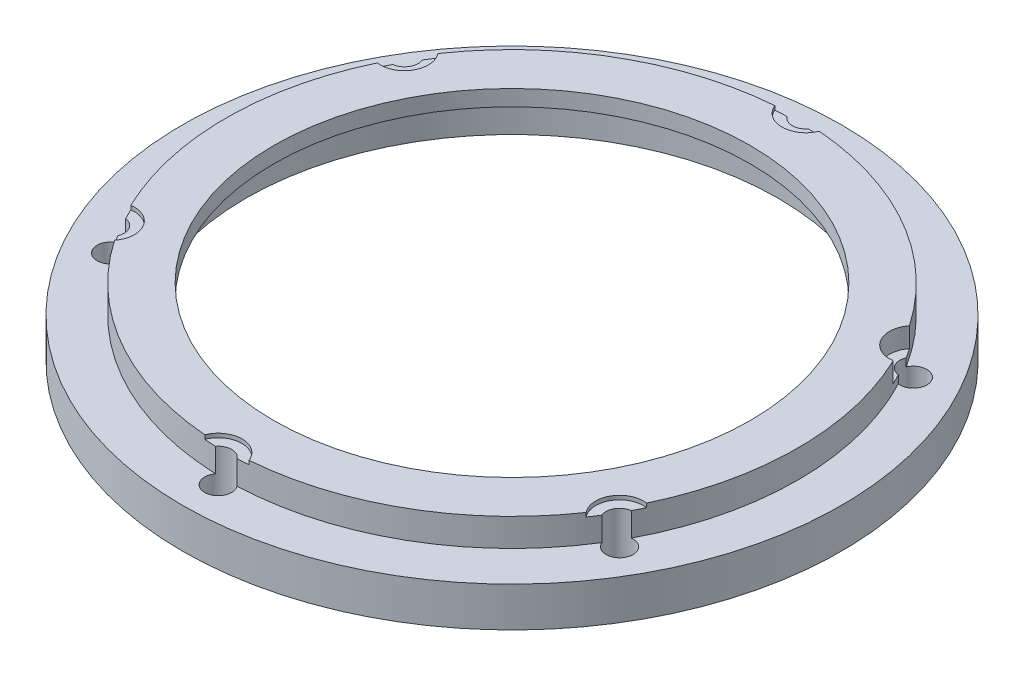
ISO-10303-21;
HEADER;
FILE_DESCRIPTION(('STEP AP214'),'2;1');
FILE_NAME('part.step','',(''),(''),'','','');
FILE_SCHEMA(('AUTOMOTIVE_DESIGN { 1 0 10303 214 1 1 1 1 }'));
ENDSEC;
DATA;
#1=APPLICATION_CONTEXT('core data for automotive mechanical design processes');
#2=APPLICATION_PROTOCOL_DEFINITION('international standard','automotive_design',2000,#1);
#3=PRODUCT_CONTEXT('',#1,'mechanical');
#4=PRODUCT('Part','Part','',(#3));
#5=PRODUCT_RELATED_PRODUCT_CATEGORY('part','',(#4));
#6=PRODUCT_DEFINITION_FORMATION('','',#4);
#7=PRODUCT_DEFINITION_CONTEXT('part definition',#1,'design');
#8=PRODUCT_DEFINITION('design','',#6,#7);
#9=PRODUCT_DEFINITION_SHAPE('','',#8);
#10=(LENGTH_UNIT() NAMED_UNIT(*) SI_UNIT(.MILLI.,.METRE.));
#11=(NAMED_UNIT(*) PLANE_ANGLE_UNIT() SI_UNIT($,.RADIAN.));
#12=(NAMED_UNIT(*) SI_UNIT($,.STERADIAN.) SOLID_ANGLE_UNIT());
#13=UNCERTAINTY_MEASURE_WITH_UNIT(LENGTH_MEASURE(1.E-05),#10,'distance_accuracy_value','');
#14=(GEOMETRIC_REPRESENTATION_CONTEXT(3) GLOBAL_UNCERTAINTY_ASSIGNED_CONTEXT((#13)) GLOBAL_UNIT_ASSIGNED_CONTEXT((#10,
#11,#12)) REPRESENTATION_CONTEXT('',''));
#15=CARTESIAN_POINT('',(0.,0.,0.));
#16=DIRECTION('',(0.,0.,1.));
#17=DIRECTION('',(1.,0.,0.));
#18=AXIS2_PLACEMENT_3D('',#15,#16,#17);
#19=CARTESIAN_POINT('',(0.,0.,0.));
#20=DIRECTION('',(0.,-1.,0.));
#21=DIRECTION('',(0.,0.,-1.));
#22=AXIS2_PLACEMENT_3D('',#19,#20,#21);
#23=CYLINDRICAL_SURFACE('',#22,36.);
#24=DIRECTION('',(0.,-1.,0.));
#25=VECTOR('',#24,1.);
#26=CARTESIAN_POINT('',(29.6893661727786,3.,-20.3602931280144));
#27=LINE('',#26,#25);
#28=CARTESIAN_POINT('',(29.6893661727786,-0.5,-20.3602931280144));
#29=VERTEX_POINT('',#28);
#30=CARTESIAN_POINT('',(29.6893661727786,2.,-20.3602931280144));
#31=VERTEX_POINT('',#30);
#32=EDGE_CURVE('E231',#29,#31,#27,.F.);
#33=ORIENTED_EDGE('',*,*,#32,.F.);
#34=CARTESIAN_POINT('',(0.,-0.500000000000001,0.));
#35=DIRECTION('',(0.,1.,0.));
#36=DIRECTION('',(0.,0.,1.));
#37=AXIS2_PLACEMENT_3D('',#34,#35,#36);
#38=CIRCLE('',#37,36.);
#39=CARTESIAN_POINT('',(30.4768823261808,-0.500000000000001,-19.1614102736758));
#40=VERTEX_POINT('',#39);
#41=EDGE_CURVE('E217',#29,#40,#38,.F.);
#42=ORIENTED_EDGE('',*,*,#41,.T.);
#43=DIRECTION('',(0.,-1.,0.));
#44=VECTOR('',#43,1.);
#45=CARTESIAN_POINT('',(30.4768823261808,-0.500000000000001,-19.1614102736758));
#46=LINE('',#45,#44);
#47=CARTESIAN_POINT('',(30.4768823261808,-1.5,-19.1614102736758));
#48=VERTEX_POINT('',#47);
#49=EDGE_CURVE('E225',#40,#48,#46,.T.);
#50=ORIENTED_EDGE('',*,*,#49,.T.);
#51=CARTESIAN_POINT('',(0.,-1.5,0.));
#52=DIRECTION('',(0.,-1.,0.));
#53=DIRECTION('',(0.,0.,-1.));
#54=AXIS2_PLACEMENT_3D('',#51,#52,#53);
#55=CIRCLE('',#54,36.);
#56=CARTESIAN_POINT('',(1.35582690624866,-1.5,-35.9744594594595));
#57=VERTEX_POINT('',#56);
#58=EDGE_CURVE('E60',#57,#48,#55,.T.);
#59=ORIENTED_EDGE('',*,*,#58,.F.);
#60=DIRECTION('',(0.,-1.,0.));
#61=VECTOR('',#60,1.);
#62=CARTESIAN_POINT('',(1.35582690624866,0.25,-35.9744594594595));
#63=LINE('',#62,#61);
#64=CARTESIAN_POINT('',(1.35582690624866,1.5,-35.9744594594595));
#65=VERTEX_POINT('',#64);
#66=EDGE_CURVE('E264',#57,#65,#63,.F.);
#67=ORIENTED_EDGE('',*,*,#66,.T.);
#68=CARTESIAN_POINT('',(0.,1.5,0.));
#69=DIRECTION('',(0.,1.,0.));
#70=DIRECTION('',(0.,0.,1.));
#71=AXIS2_PLACEMENT_3D('',#68,#69,#70);
#72=CIRCLE('',#71,36.);
#73=CARTESIAN_POINT('',(2.78784799096814,1.5,-35.8918918918919));
#74=VERTEX_POINT('',#73);
#75=EDGE_CURVE('E419',#74,#65,#72,.T.);
#76=ORIENTED_EDGE('',*,*,#75,.F.);
#77=DIRECTION('',(0.,-1.,0.));
#78=VECTOR('',#77,1.);
#79=CARTESIAN_POINT('',(2.78784799096814,3.,-35.8918918918919));
#80=LINE('',#79,#78);
#81=CARTESIAN_POINT('',(2.78784799096815,2.,-35.8918918918919));
#82=VERTEX_POINT('',#81);
#83=EDGE_CURVE('E258',#82,#74,#80,.T.);
#84=ORIENTED_EDGE('',*,*,#83,.F.);
#85=CARTESIAN_POINT('',(0.,2.,0.));
#86=DIRECTION('',(0.,-1.,0.));
#87=DIRECTION('',(0.,0.,-1.));
#88=AXIS2_PLACEMENT_3D('',#85,#86,#87);
#89=CIRCLE('',#88,36.);
#90=EDGE_CURVE('E234',#82,#31,#89,.T.);
#91=ORIENTED_EDGE('',*,*,#90,.T.);
#92=EDGE_LOOP('',(#33,#42,#50,#59,#67,#76,#84,#91));
#93=FACE_BOUND('',#92,.T.);
#94=ADVANCED_FACE('F38',(#93),#23,.T.);
#95=CARTESIAN_POINT('',(31.832709232429,-1.5,-16.813049185785));
#96=VERTEX_POINT('',#95);
#97=CARTESIAN_POINT('',(31.8327092324314,-1.5,16.8130491857806));
#98=VERTEX_POINT('',#97);
#99=EDGE_CURVE('E53',#96,#98,#55,.T.);
#100=ORIENTED_EDGE('',*,*,#99,.F.);
#101=DIRECTION('',(0.,-1.,0.));
#102=VECTOR('',#101,1.);
#103=CARTESIAN_POINT('',(31.832709232429,-0.500000000000001,-16.813049185785));
#104=LINE('',#103,#102);
#105=CARTESIAN_POINT('',(31.832709232429,-0.500000000000001,-16.813049185785));
#106=VERTEX_POINT('',#105);
#107=EDGE_CURVE('E221',#106,#96,#104,.T.);
#108=ORIENTED_EDGE('',*,*,#107,.F.);
#109=CARTESIAN_POINT('',(32.4772141637468,-0.500000000000001,-15.5315987638788));
#110=VERTEX_POINT('',#109);
#111=EDGE_CURVE('E215',#106,#110,#38,.F.);
#112=ORIENTED_EDGE('',*,*,#111,.T.);
#113=DIRECTION('',(0.,-1.,0.));
#114=VECTOR('',#113,1.);
#115=CARTESIAN_POINT('',(32.4772141637468,3.,-15.5315987638789));
#116=LINE('',#115,#114);
#117=CARTESIAN_POINT('',(32.4772141637468,2.,-15.5315987638789));
#118=VERTEX_POINT('',#117);
#119=EDGE_CURVE('E198',#118,#110,#116,.T.);
#120=ORIENTED_EDGE('',*,*,#119,.F.);
#121=CARTESIAN_POINT('',(32.4772141637488,2.,15.5315987638746));
#122=VERTEX_POINT('',#121);
#123=EDGE_CURVE('E332',#118,#122,#89,.T.);
#124=ORIENTED_EDGE('',*,*,#123,.T.);
#125=DIRECTION('',(0.,-1.,0.));
#126=VECTOR('',#125,1.);
#127=CARTESIAN_POINT('',(32.4772141637488,3.,15.5315987638746));
#128=LINE('',#127,#126);
#129=CARTESIAN_POINT('',(32.4772141637488,1.5,15.5315987638746));
#130=VERTEX_POINT('',#129);
#131=EDGE_CURVE('E208',#130,#122,#128,.F.);
#132=ORIENTED_EDGE('',*,*,#131,.F.);
#133=CARTESIAN_POINT('',(0.,1.5,0.));
#134=DIRECTION('',(0.,1.,0.));
#135=DIRECTION('',(0.,0.,1.));
#136=AXIS2_PLACEMENT_3D('',#133,#134,#135);
#137=CIRCLE('',#136,36.);
#138=CARTESIAN_POINT('',(31.8327092324314,1.5,16.8130491857806));
#139=VERTEX_POINT('',#138);
#140=EDGE_CURVE('E431',#139,#130,#137,.T.);
#141=ORIENTED_EDGE('',*,*,#140,.F.);
#142=DIRECTION('',(0.,-1.,0.));
#143=VECTOR('',#142,1.);
#144=CARTESIAN_POINT('',(31.8327092324314,0.25,16.8130491857806));
#145=LINE('',#144,#143);
#146=EDGE_CURVE('E280',#139,#98,#145,.T.);
#147=ORIENTED_EDGE('',*,*,#146,.T.);
#148=EDGE_LOOP('',(#100,#108,#112,#120,#124,#132,#141,#147));
#149=FACE_BOUND('',#148,.T.);
#150=ADVANCED_FACE('F219',(#149),#23,.T.);
#151=CARTESIAN_POINT('',(32.042939940025,2.001,-18.5000000000014));
#152=DIRECTION('',(0.,-1.,0.));
#153=DIRECTION('',(0.,0.,-1.));
#154=AXIS2_PLACEMENT_3D('',#151,#152,#153);
#155=CYLINDRICAL_SURFACE('',#154,1.70000000000045);
#156=CARTESIAN_POINT('',(32.042939940025,-6.5,-18.5000000000014));
#157=DIRECTION('',(0.,1.,0.));
#158=DIRECTION('',(0.,0.,1.));
#159=AXIS2_PLACEMENT_3D('',#156,#157,#158);
#160=CIRCLE('',#159,1.70000000000045);
#161=CARTESIAN_POINT('',(32.042939940025,-6.5,-16.8000000000009));
#162=VERTEX_POINT('',#161);
#163=EDGE_CURVE('E270',#162,#162,#160,.F.);
#164=ORIENTED_EDGE('',*,*,#163,.T.);
#165=EDGE_LOOP('',(#164));
#166=FACE_BOUND('',#165,.T.);
#167=CARTESIAN_POINT('',(32.042939940025,-1.5,-18.5000000000014));
#168=DIRECTION('',(0.,1.,0.));
#169=DIRECTION('',(0.,0.,1.));
#170=AXIS2_PLACEMENT_3D('',#167,#168,#169);
#171=CIRCLE('',#170,1.70000000000045);
#172=EDGE_CURVE('E265',#96,#48,#171,.T.);
#173=ORIENTED_EDGE('',*,*,#172,.T.);
#174=ORIENTED_EDGE('',*,*,#49,.F.);
#175=CARTESIAN_POINT('',(32.042939940025,-0.500000000000001,-18.5000000000014));
#176=DIRECTION('',(0.,1.,0.));
#177=DIRECTION('',(0.,0.,1.));
#178=AXIS2_PLACEMENT_3D('',#175,#176,#177);
#179=CIRCLE('',#178,1.70000000000045);
#180=EDGE_CURVE('E223',#106,#40,#179,.F.);
#181=ORIENTED_EDGE('',*,*,#180,.F.);
#182=ORIENTED_EDGE('',*,*,#107,.T.);
#183=EDGE_LOOP('',(#173,#174,#181,#182));
#184=FACE_BOUND('',#183,.T.);
#185=ADVANCED_FACE('F514',(#166,#184),#155,.F.);
#186=DIRECTION('',(0.,-1.,0.));
#187=VECTOR('',#186,1.);
#188=CARTESIAN_POINT('',(-2.78784799096814,3.,-35.8918918918919));
#189=LINE('',#188,#187);
#190=CARTESIAN_POINT('',(-2.78784799096814,1.5,-35.8918918918919));
#191=VERTEX_POINT('',#190);
#192=CARTESIAN_POINT('',(-2.78784799096814,2.,-35.8918918918919));
#193=VERTEX_POINT('',#192);
#194=EDGE_CURVE('E11',#191,#193,#189,.F.);
#195=ORIENTED_EDGE('',*,*,#194,.F.);
#196=CARTESIAN_POINT('',(0.,1.5,0.));
#197=DIRECTION('',(0.,1.,0.));
#198=DIRECTION('',(0.,0.,1.));
#199=AXIS2_PLACEMENT_3D('',#196,#197,#198);
#200=CIRCLE('',#199,36.);
#201=CARTESIAN_POINT('',(-1.35582690624866,1.5,-35.9744594594595));
#202=VERTEX_POINT('',#201);
#203=EDGE_CURVE('E417',#202,#191,#200,.T.);
#204=ORIENTED_EDGE('',*,*,#203,.F.);
#205=DIRECTION('',(0.,-1.,0.));
#206=VECTOR('',#205,1.);
#207=CARTESIAN_POINT('',(-1.35582690624866,0.25,-35.9744594594595));
#208=LINE('',#207,#206);
#209=CARTESIAN_POINT('',(-1.35582690624866,-1.5,-35.9744594594595));
#210=VERTEX_POINT('',#209);
#211=EDGE_CURVE('E268',#202,#210,#208,.T.);
#212=ORIENTED_EDGE('',*,*,#211,.T.);
#213=CARTESIAN_POINT('',(-30.4768823261798,-1.5,-19.1614102736773));
#214=VERTEX_POINT('',#213);
#215=EDGE_CURVE('E326',#214,#210,#55,.T.);
#216=ORIENTED_EDGE('',*,*,#215,.F.);
#217=DIRECTION('',(0.,-1.,0.));
#218=VECTOR('',#217,1.);
#219=CARTESIAN_POINT('',(-30.4768823261798,0.25,-19.1614102736773));
#220=LINE('',#219,#218);
#221=CARTESIAN_POINT('',(-30.4768823261798,1.5,-19.1614102736773));
#222=VERTEX_POINT('',#221);
#223=EDGE_CURVE('E273',#214,#222,#220,.F.);
#224=ORIENTED_EDGE('',*,*,#223,.T.);
#225=CARTESIAN_POINT('',(0.,1.5,0.));
#226=DIRECTION('',(0.,1.,0.));
#227=DIRECTION('',(0.,0.,1.));
#228=AXIS2_PLACEMENT_3D('',#225,#226,#227);
#229=CIRCLE('',#228,36.);
#230=CARTESIAN_POINT('',(-29.6893661727782,1.5,-20.3602931280149));
#231=VERTEX_POINT('',#230);
#232=EDGE_CURVE('E399',#231,#222,#229,.T.);
#233=ORIENTED_EDGE('',*,*,#232,.F.);
#234=DIRECTION('',(0.,-1.,0.));
#235=VECTOR('',#234,1.);
#236=CARTESIAN_POINT('',(-29.6893661727782,3.,-20.3602931280149));
#237=LINE('',#236,#235);
#238=CARTESIAN_POINT('',(-29.6893661727783,2.,-20.3602931280149));
#239=VERTEX_POINT('',#238);
#240=EDGE_CURVE('E254',#239,#231,#237,.T.);
#241=ORIENTED_EDGE('',*,*,#240,.F.);
#242=EDGE_CURVE('E328',#239,#193,#89,.T.);
#243=ORIENTED_EDGE('',*,*,#242,.T.);
#244=EDGE_LOOP('',(#195,#204,#212,#216,#224,#233,#241,#243));
#245=FACE_BOUND('',#244,.T.);
#246=ADVANCED_FACE('F396',(#245),#23,.T.);
#247=DIRECTION('',(0.,-1.,0.));
#248=VECTOR('',#247,1.);
#249=CARTESIAN_POINT('',(-32.4772141637484,3.,-15.5315987638754));
#250=LINE('',#249,#248);
#251=CARTESIAN_POINT('',(-32.4772141637484,1.5,-15.5315987638754));
#252=VERTEX_POINT('',#251);
#253=CARTESIAN_POINT('',(-32.4772141637484,2.,-15.5315987638754));
#254=VERTEX_POINT('',#253);
#255=EDGE_CURVE('E46',#252,#254,#250,.F.);
#256=ORIENTED_EDGE('',*,*,#255,.F.);
#257=CARTESIAN_POINT('',(0.,1.5,0.));
#258=DIRECTION('',(0.,1.,0.));
#259=DIRECTION('',(0.,0.,1.));
#260=AXIS2_PLACEMENT_3D('',#257,#258,#259);
#261=CIRCLE('',#260,36.);
#262=CARTESIAN_POINT('',(-31.8327092324314,1.5,-16.8130491857806));
#263=VERTEX_POINT('',#262);
#264=EDGE_CURVE('E402',#263,#252,#261,.T.);
#265=ORIENTED_EDGE('',*,*,#264,.F.);
#266=DIRECTION('',(0.,-1.,0.));
#267=VECTOR('',#266,1.);
#268=CARTESIAN_POINT('',(-31.8327092324314,0.25,-16.8130491857806));
#269=LINE('',#268,#267);
#270=CARTESIAN_POINT('',(-31.8327092324314,-1.5,-16.8130491857806));
#271=VERTEX_POINT('',#270);
#272=EDGE_CURVE('E276',#263,#271,#269,.T.);
#273=ORIENTED_EDGE('',*,*,#272,.T.);
#274=CARTESIAN_POINT('',(-31.8327092324307,-1.5,16.8130491857819));
#275=VERTEX_POINT('',#274);
#276=EDGE_CURVE('E452',#275,#271,#55,.T.);
#277=ORIENTED_EDGE('',*,*,#276,.F.);
#278=DIRECTION('',(0.,-1.,0.));
#279=VECTOR('',#278,1.);
#280=CARTESIAN_POINT('',(-31.8327092324307,0.25,16.8130491857819));
#281=LINE('',#280,#279);
#282=CARTESIAN_POINT('',(-31.8327092324307,1.5,16.8130491857819));
#283=VERTEX_POINT('',#282);
#284=EDGE_CURVE('E299',#275,#283,#281,.F.);
#285=ORIENTED_EDGE('',*,*,#284,.T.);
#286=CARTESIAN_POINT('',(0.,1.5,0.));
#287=DIRECTION('',(0.,1.,0.));
#288=DIRECTION('',(0.,0.,1.));
#289=AXIS2_PLACEMENT_3D('',#286,#287,#288);
#290=CIRCLE('',#289,36.);
#291=CARTESIAN_POINT('',(-32.4772141637477,1.5,15.5315987638769));
#292=VERTEX_POINT('',#291);
#293=EDGE_CURVE('E425',#292,#283,#290,.T.);
#294=ORIENTED_EDGE('',*,*,#293,.F.);
#295=DIRECTION('',(0.,-1.,0.));
#296=VECTOR('',#295,1.);
#297=CARTESIAN_POINT('',(-32.4772141637477,3.,15.5315987638769));
#298=LINE('',#297,#296);
#299=CARTESIAN_POINT('',(-32.4772141637477,2.,15.531598763877));
#300=VERTEX_POINT('',#299);
#301=EDGE_CURVE('E250',#300,#292,#298,.T.);
#302=ORIENTED_EDGE('',*,*,#301,.F.);
#303=EDGE_CURVE('E386',#300,#254,#89,.T.);
#304=ORIENTED_EDGE('',*,*,#303,.T.);
#305=EDGE_LOOP('',(#256,#265,#273,#277,#285,#294,#302,#304));
#306=FACE_BOUND('',#305,.T.);
#307=ADVANCED_FACE('F389',(#306),#23,.T.);
#308=DIRECTION('',(0.,-1.,0.));
#309=VECTOR('',#308,1.);
#310=CARTESIAN_POINT('',(-29.6893661727756,3.,20.3602931280187));
#311=LINE('',#310,#309);
#312=CARTESIAN_POINT('',(-29.6893661727757,1.5,20.3602931280187));
#313=VERTEX_POINT('',#312);
#314=CARTESIAN_POINT('',(-29.6893661727756,2.,20.3602931280187));
#315=VERTEX_POINT('',#314);
#316=EDGE_CURVE('E367',#313,#315,#311,.F.);
#317=ORIENTED_EDGE('',*,*,#316,.F.);
#318=CARTESIAN_POINT('',(0.,1.5,0.));
#319=DIRECTION('',(0.,1.,0.));
#320=DIRECTION('',(0.,0.,1.));
#321=AXIS2_PLACEMENT_3D('',#318,#319,#320);
#322=CIRCLE('',#321,36.);
#323=CARTESIAN_POINT('',(-30.4768823261773,1.5,19.1614102736814));
#324=VERTEX_POINT('',#323);
#325=EDGE_CURVE('E423',#324,#313,#322,.T.);
#326=ORIENTED_EDGE('',*,*,#325,.F.);
#327=DIRECTION('',(0.,-1.,0.));
#328=VECTOR('',#327,1.);
#329=CARTESIAN_POINT('',(-30.4768823261773,0.25,19.1614102736814));
#330=LINE('',#329,#328);
#331=CARTESIAN_POINT('',(-30.4768823261773,-1.5,19.1614102736814));
#332=VERTEX_POINT('',#331);
#333=EDGE_CURVE('E293',#324,#332,#330,.T.);
#334=ORIENTED_EDGE('',*,*,#333,.T.);
#335=CARTESIAN_POINT('',(-1.35582690624957,-1.5,35.9744594594594));
#336=VERTEX_POINT('',#335);
#337=EDGE_CURVE('E450',#336,#332,#55,.T.);
#338=ORIENTED_EDGE('',*,*,#337,.F.);
#339=DIRECTION('',(0.,-1.,0.));
#340=VECTOR('',#339,1.);
#341=CARTESIAN_POINT('',(-1.35582690624957,0.25,35.9744594594594));
#342=LINE('',#341,#340);
#343=CARTESIAN_POINT('',(-1.35582690624957,1.5,35.9744594594594));
#344=VERTEX_POINT('',#343);
#345=EDGE_CURVE('E292',#336,#344,#342,.F.);
#346=ORIENTED_EDGE('',*,*,#345,.T.);
#347=CARTESIAN_POINT('',(0.,1.5,0.));
#348=DIRECTION('',(0.,1.,0.));
#349=DIRECTION('',(0.,0.,1.));
#350=AXIS2_PLACEMENT_3D('',#347,#348,#349);
#351=CIRCLE('',#350,36.);
#352=CARTESIAN_POINT('',(-2.78784799096848,1.5,35.8918918918919));
#353=VERTEX_POINT('',#352);
#354=EDGE_CURVE('E429',#353,#344,#351,.T.);
#355=ORIENTED_EDGE('',*,*,#354,.F.);
#356=DIRECTION('',(0.,-1.,0.));
#357=VECTOR('',#356,1.);
#358=CARTESIAN_POINT('',(-2.78784799096848,3.,35.8918918918919));
#359=LINE('',#358,#357);
#360=CARTESIAN_POINT('',(-2.78784799096849,2.,35.8918918918919));
#361=VERTEX_POINT('',#360);
#362=EDGE_CURVE('E246',#361,#353,#359,.T.);
#363=ORIENTED_EDGE('',*,*,#362,.F.);
#364=EDGE_CURVE('E391',#361,#315,#89,.T.);
#365=ORIENTED_EDGE('',*,*,#364,.T.);
#366=EDGE_LOOP('',(#317,#326,#334,#338,#346,#355,#363,#365));
#367=FACE_BOUND('',#366,.T.);
#368=ADVANCED_FACE('F485',(#367),#23,.T.);
#369=DIRECTION('',(0.,-1.,0.));
#370=VECTOR('',#369,1.);
#371=CARTESIAN_POINT('',(2.78784799097458,3.,35.8918918918914));
#372=LINE('',#371,#370);
#373=CARTESIAN_POINT('',(2.78784799097458,1.5,35.8918918918914));
#374=VERTEX_POINT('',#373);
#375=CARTESIAN_POINT('',(2.78784799097458,2.,35.8918918918914));
#376=VERTEX_POINT('',#375);
#377=EDGE_CURVE('E365',#374,#376,#372,.F.);
#378=ORIENTED_EDGE('',*,*,#377,.F.);
#379=CARTESIAN_POINT('',(0.,1.5,0.));
#380=DIRECTION('',(0.,1.,0.));
#381=DIRECTION('',(0.,0.,1.));
#382=AXIS2_PLACEMENT_3D('',#379,#380,#381);
#383=CIRCLE('',#382,36.);
#384=CARTESIAN_POINT('',(1.35582690625568,1.5,35.9744594594592));
#385=VERTEX_POINT('',#384);
#386=EDGE_CURVE('E427',#385,#374,#383,.T.);
#387=ORIENTED_EDGE('',*,*,#386,.F.);
#388=DIRECTION('',(0.,-1.,0.));
#389=VECTOR('',#388,1.);
#390=CARTESIAN_POINT('',(1.35582690625567,0.25,35.9744594594592));
#391=LINE('',#390,#389);
#392=CARTESIAN_POINT('',(1.35582690625567,-1.5,35.9744594594592));
#393=VERTEX_POINT('',#392);
#394=EDGE_CURVE('E285',#385,#393,#391,.T.);
#395=ORIENTED_EDGE('',*,*,#394,.T.);
#396=CARTESIAN_POINT('',(30.4768823261814,-1.5,19.1614102736748));
#397=VERTEX_POINT('',#396);
#398=EDGE_CURVE('E329',#397,#393,#55,.T.);
#399=ORIENTED_EDGE('',*,*,#398,.F.);
#400=DIRECTION('',(0.,-1.,0.));
#401=VECTOR('',#400,1.);
#402=CARTESIAN_POINT('',(30.4768823261814,0.25,19.1614102736748));
#403=LINE('',#402,#401);
#404=CARTESIAN_POINT('',(30.4768823261814,1.5,19.1614102736748));
#405=VERTEX_POINT('',#404);
#406=EDGE_CURVE('E284',#397,#405,#403,.F.);
#407=ORIENTED_EDGE('',*,*,#406,.T.);
#408=CARTESIAN_POINT('',(0.,1.5,0.));
#409=DIRECTION('',(0.,1.,0.));
#410=DIRECTION('',(0.,0.,1.));
#411=AXIS2_PLACEMENT_3D('',#408,#409,#410);
#412=CIRCLE('',#411,36.);
#413=CARTESIAN_POINT('',(29.6893661727794,1.5,20.3602931280132));
#414=VERTEX_POINT('',#413);
#415=EDGE_CURVE('E239',#414,#405,#412,.T.);
#416=ORIENTED_EDGE('',*,*,#415,.F.);
#417=DIRECTION('',(0.,-1.,0.));
#418=VECTOR('',#417,1.);
#419=CARTESIAN_POINT('',(29.6893661727794,3.,20.3602931280132));
#420=LINE('',#419,#418);
#421=CARTESIAN_POINT('',(29.6893661727794,2.,20.3602931280132));
#422=VERTEX_POINT('',#421);
#423=EDGE_CURVE('E237',#422,#414,#420,.T.);
#424=ORIENTED_EDGE('',*,*,#423,.F.);
#425=EDGE_CURVE('E393',#422,#376,#89,.T.);
#426=ORIENTED_EDGE('',*,*,#425,.T.);
#427=EDGE_LOOP('',(#378,#387,#395,#399,#407,#416,#424,#426));
#428=FACE_BOUND('',#427,.T.);
#429=ADVANCED_FACE('F445',(#428),#23,.T.);
#430=CARTESIAN_POINT('',(32.0429399400266,2.001,18.4999999999986));
#431=DIRECTION('',(0.,-1.,0.));
#432=DIRECTION('',(0.,0.,-1.));
#433=AXIS2_PLACEMENT_3D('',#430,#431,#432);
#434=CYLINDRICAL_SURFACE('',#433,1.70000000000202);
#435=CARTESIAN_POINT('',(32.0429399400266,-6.5,18.4999999999986));
#436=DIRECTION('',(0.,1.,0.));
#437=DIRECTION('',(0.,0.,1.));
#438=AXIS2_PLACEMENT_3D('',#435,#436,#437);
#439=CIRCLE('',#438,1.70000000000202);
#440=CARTESIAN_POINT('',(32.0429399400266,-6.5,20.2000000000007));
#441=VERTEX_POINT('',#440);
#442=EDGE_CURVE('E305',#441,#441,#439,.F.);
#443=ORIENTED_EDGE('',*,*,#442,.T.);
#444=EDGE_LOOP('',(#443));
#445=FACE_BOUND('',#444,.T.);
#446=ORIENTED_EDGE('',*,*,#146,.F.);
#447=CARTESIAN_POINT('',(32.0429399400266,1.5,18.4999999999986));
#448=DIRECTION('',(0.,1.,0.));
#449=DIRECTION('',(0.,0.,1.));
#450=AXIS2_PLACEMENT_3D('',#447,#448,#449);
#451=CIRCLE('',#450,1.70000000000202);
#452=EDGE_CURVE('E209',#139,#405,#451,.T.);
#453=ORIENTED_EDGE('',*,*,#452,.T.);
#454=ORIENTED_EDGE('',*,*,#406,.F.);
#455=CARTESIAN_POINT('',(32.0429399400266,-1.5,18.4999999999986));
#456=DIRECTION('',(0.,1.,0.));
#457=DIRECTION('',(0.,0.,1.));
#458=AXIS2_PLACEMENT_3D('',#455,#456,#457);
#459=CIRCLE('',#458,1.70000000000202);
#460=EDGE_CURVE('E281',#397,#98,#459,.T.);
#461=ORIENTED_EDGE('',*,*,#460,.T.);
#462=EDGE_LOOP('',(#446,#453,#454,#461));
#463=FACE_BOUND('',#462,.T.);
#464=ADVANCED_FACE('F441',(#445,#463),#434,.F.);
#465=CARTESIAN_POINT('',(3.14121616730431E-12,2.001,37.));
#466=DIRECTION('',(0.,-1.,0.));
#467=DIRECTION('',(0.,0.,-1.));
#468=AXIS2_PLACEMENT_3D('',#465,#466,#467);
#469=CYLINDRICAL_SURFACE('',#468,1.70000000000325);
#470=CARTESIAN_POINT('',(3.14121616730431E-12,-6.5,37.));
#471=DIRECTION('',(0.,1.,0.));
#472=DIRECTION('',(0.,0.,1.));
#473=AXIS2_PLACEMENT_3D('',#470,#471,#472);
#474=CIRCLE('',#473,1.70000000000325);
#475=CARTESIAN_POINT('',(3.14121616730431E-12,-6.5,38.7000000000032));
#476=VERTEX_POINT('',#475);
#477=EDGE_CURVE('E308',#476,#476,#474,.F.);
#478=ORIENTED_EDGE('',*,*,#477,.T.);
#479=EDGE_LOOP('',(#478));
#480=FACE_BOUND('',#479,.T.);
#481=ORIENTED_EDGE('',*,*,#394,.F.);
#482=CARTESIAN_POINT('',(3.14121616730431E-12,1.5,37.));
#483=DIRECTION('',(0.,1.,0.));
#484=DIRECTION('',(0.,0.,1.));
#485=AXIS2_PLACEMENT_3D('',#482,#483,#484);
#486=CIRCLE('',#485,1.70000000000325);
#487=EDGE_CURVE('E359',#385,#344,#486,.T.);
#488=ORIENTED_EDGE('',*,*,#487,.T.);
#489=ORIENTED_EDGE('',*,*,#345,.F.);
#490=CARTESIAN_POINT('',(3.14121616730431E-12,-1.5,37.));
#491=DIRECTION('',(0.,1.,0.));
#492=DIRECTION('',(0.,0.,1.));
#493=AXIS2_PLACEMENT_3D('',#490,#491,#492);
#494=CIRCLE('',#493,1.70000000000325);
#495=EDGE_CURVE('E289',#336,#393,#494,.T.);
#496=ORIENTED_EDGE('',*,*,#495,.T.);
#497=EDGE_LOOP('',(#481,#488,#489,#496));
#498=FACE_BOUND('',#497,.T.);
#499=ADVANCED_FACE('F489',(#480,#498),#469,.F.);
#500=CARTESIAN_POINT('',(-32.0429399400219,2.001,18.5000000000014));
#501=DIRECTION('',(0.,-1.,0.));
#502=DIRECTION('',(0.,0.,-1.));
#503=AXIS2_PLACEMENT_3D('',#500,#501,#502);
#504=CYLINDRICAL_SURFACE('',#503,1.70000000000299);
#505=CARTESIAN_POINT('',(-32.0429399400219,-6.5,18.5000000000014));
#506=DIRECTION('',(0.,1.,0.));
#507=DIRECTION('',(0.,0.,1.));
#508=AXIS2_PLACEMENT_3D('',#505,#506,#507);
#509=CIRCLE('',#508,1.70000000000299);
#510=CARTESIAN_POINT('',(-32.0429399400219,-6.5,20.2000000000044));
#511=VERTEX_POINT('',#510);
#512=EDGE_CURVE('E311',#511,#511,#509,.F.);
#513=ORIENTED_EDGE('',*,*,#512,.T.);
#514=EDGE_LOOP('',(#513));
#515=FACE_BOUND('',#514,.T.);
#516=ORIENTED_EDGE('',*,*,#333,.F.);
#517=CARTESIAN_POINT('',(-32.0429399400219,1.5,18.5000000000014));
#518=DIRECTION('',(0.,1.,0.));
#519=DIRECTION('',(0.,0.,1.));
#520=AXIS2_PLACEMENT_3D('',#517,#518,#519);
#521=CIRCLE('',#520,1.70000000000299);
#522=EDGE_CURVE('E356',#324,#283,#521,.T.);
#523=ORIENTED_EDGE('',*,*,#522,.T.);
#524=ORIENTED_EDGE('',*,*,#284,.F.);
#525=CARTESIAN_POINT('',(-32.0429399400219,-1.5,18.5000000000014));
#526=DIRECTION('',(0.,1.,0.));
#527=DIRECTION('',(0.,0.,1.));
#528=AXIS2_PLACEMENT_3D('',#525,#526,#527);
#529=CIRCLE('',#528,1.70000000000299);
#530=EDGE_CURVE('E278',#275,#332,#529,.T.);
#531=ORIENTED_EDGE('',*,*,#530,.T.);
#532=EDGE_LOOP('',(#516,#523,#524,#531));
#533=FACE_BOUND('',#532,.T.);
#534=ADVANCED_FACE('F493',(#515,#533),#504,.F.);
#535=CARTESIAN_POINT('',(-32.0429399400235,2.001,-18.4999999999986));
#536=DIRECTION('',(0.,-1.,0.));
#537=DIRECTION('',(0.,0.,-1.));
#538=AXIS2_PLACEMENT_3D('',#535,#536,#537);
#539=CYLINDRICAL_SURFACE('',#538,1.70000000000158);
#540=CARTESIAN_POINT('',(-32.0429399400235,-6.5,-18.4999999999986));
#541=DIRECTION('',(0.,1.,0.));
#542=DIRECTION('',(0.,0.,1.));
#543=AXIS2_PLACEMENT_3D('',#540,#541,#542);
#544=CIRCLE('',#543,1.70000000000158);
#545=CARTESIAN_POINT('',(-32.0429399400235,-6.5,-16.799999999997));
#546=VERTEX_POINT('',#545);
#547=EDGE_CURVE('E314',#546,#546,#544,.F.);
#548=ORIENTED_EDGE('',*,*,#547,.T.);
#549=EDGE_LOOP('',(#548));
#550=FACE_BOUND('',#549,.T.);
#551=ORIENTED_EDGE('',*,*,#272,.F.);
#552=CARTESIAN_POINT('',(-32.0429399400235,1.5,-18.4999999999986));
#553=DIRECTION('',(0.,1.,0.));
#554=DIRECTION('',(0.,0.,1.));
#555=AXIS2_PLACEMENT_3D('',#552,#553,#554);
#556=CIRCLE('',#555,1.70000000000158);
#557=EDGE_CURVE('E353',#263,#222,#556,.T.);
#558=ORIENTED_EDGE('',*,*,#557,.T.);
#559=ORIENTED_EDGE('',*,*,#223,.F.);
#560=CARTESIAN_POINT('',(-32.0429399400235,-1.5,-18.4999999999986));
#561=DIRECTION('',(0.,1.,0.));
#562=DIRECTION('',(0.,0.,1.));
#563=AXIS2_PLACEMENT_3D('',#560,#561,#562);
#564=CIRCLE('',#563,1.70000000000158);
#565=EDGE_CURVE('E260',#214,#271,#564,.T.);
#566=ORIENTED_EDGE('',*,*,#565,.T.);
#567=EDGE_LOOP('',(#551,#558,#559,#566));
#568=FACE_BOUND('',#567,.T.);
#569=ADVANCED_FACE('F496',(#550,#568),#539,.F.);
#570=CARTESIAN_POINT('',(0.,2.001,-37.));
#571=DIRECTION('',(0.,-1.,0.));
#572=DIRECTION('',(0.,0.,-1.));
#573=AXIS2_PLACEMENT_3D('',#570,#571,#572);
#574=CYLINDRICAL_SURFACE('',#573,1.7);
#575=CARTESIAN_POINT('',(0.,-6.5,-37.));
#576=DIRECTION('',(0.,1.,0.));
#577=DIRECTION('',(0.,0.,1.));
#578=AXIS2_PLACEMENT_3D('',#575,#576,#577);
#579=CIRCLE('',#578,1.7);
#580=CARTESIAN_POINT('',(0.,-6.5,-35.3));
#581=VERTEX_POINT('',#580);
#582=EDGE_CURVE('E317',#581,#581,#579,.F.);
#583=ORIENTED_EDGE('',*,*,#582,.T.);
#584=EDGE_LOOP('',(#583));
#585=FACE_BOUND('',#584,.T.);
#586=ORIENTED_EDGE('',*,*,#211,.F.);
#587=CARTESIAN_POINT('',(0.,1.5,-37.));
#588=DIRECTION('',(0.,1.,0.));
#589=DIRECTION('',(0.,0.,1.));
#590=AXIS2_PLACEMENT_3D('',#587,#588,#589);
#591=CIRCLE('',#590,1.7);
#592=EDGE_CURVE('E350',#202,#65,#591,.T.);
#593=ORIENTED_EDGE('',*,*,#592,.T.);
#594=ORIENTED_EDGE('',*,*,#66,.F.);
#595=CARTESIAN_POINT('',(0.,-1.5,-37.));
#596=DIRECTION('',(0.,1.,0.));
#597=DIRECTION('',(0.,0.,1.));
#598=AXIS2_PLACEMENT_3D('',#595,#596,#597);
#599=CIRCLE('',#598,1.7);
#600=EDGE_CURVE('E261',#57,#210,#599,.T.);
#601=ORIENTED_EDGE('',*,*,#600,.T.);
#602=EDGE_LOOP('',(#586,#593,#594,#601));
#603=FACE_BOUND('',#602,.T.);
#604=ADVANCED_FACE('F464',(#585,#603),#574,.F.);
#605=CARTESIAN_POINT('',(0.,2.,30.));
#606=DIRECTION('',(0.,-1.,0.));
#607=DIRECTION('',(0.,0.,-1.));
#608=AXIS2_PLACEMENT_3D('',#605,#606,#607);
#609=PLANE('',#608);
#610=CARTESIAN_POINT('',(0.,2.,-37.));
#611=DIRECTION('',(0.,-1.,0.));
#612=DIRECTION('',(0.,0.,-1.));
#613=AXIS2_PLACEMENT_3D('',#610,#611,#612);
#614=CIRCLE('',#613,3.);
#615=EDGE_CURVE('E256',#193,#82,#614,.F.);
#616=ORIENTED_EDGE('',*,*,#615,.F.);
#617=ORIENTED_EDGE('',*,*,#242,.F.);
#618=CARTESIAN_POINT('',(-32.0429399400235,2.,-18.4999999999986));
#619=DIRECTION('',(0.,-1.,0.));
#620=DIRECTION('',(0.,0.,-1.));
#621=AXIS2_PLACEMENT_3D('',#618,#619,#620);
#622=CIRCLE('',#621,3.00000000000158);
#623=EDGE_CURVE('E252',#254,#239,#622,.F.);
#624=ORIENTED_EDGE('',*,*,#623,.F.);
#625=ORIENTED_EDGE('',*,*,#303,.F.);
#626=CARTESIAN_POINT('',(-32.0429399400219,2.,18.5000000000014));
#627=DIRECTION('',(0.,-1.,0.));
#628=DIRECTION('',(0.,0.,-1.));
#629=AXIS2_PLACEMENT_3D('',#626,#627,#628);
#630=CIRCLE('',#629,3.00000000000299);
#631=EDGE_CURVE('E248',#315,#300,#630,.F.);
#632=ORIENTED_EDGE('',*,*,#631,.F.);
#633=ORIENTED_EDGE('',*,*,#364,.F.);
#634=CARTESIAN_POINT('',(3.14121616730431E-12,2.,37.));
#635=DIRECTION('',(0.,-1.,0.));
#636=DIRECTION('',(0.,0.,-1.));
#637=AXIS2_PLACEMENT_3D('',#634,#635,#636);
#638=CIRCLE('',#637,3.00000000000325);
#639=EDGE_CURVE('E244',#376,#361,#638,.F.);
#640=ORIENTED_EDGE('',*,*,#639,.F.);
#641=ORIENTED_EDGE('',*,*,#425,.F.);
#642=CARTESIAN_POINT('',(32.0429399400266,2.,18.4999999999986));
#643=DIRECTION('',(0.,-1.,0.));
#644=DIRECTION('',(0.,0.,-1.));
#645=AXIS2_PLACEMENT_3D('',#642,#643,#644);
#646=CIRCLE('',#645,3.00000000000203);
#647=EDGE_CURVE('E235',#122,#422,#646,.F.);
#648=ORIENTED_EDGE('',*,*,#647,.F.);
#649=ORIENTED_EDGE('',*,*,#123,.F.);
#650=CARTESIAN_POINT('',(32.042939940025,2.,-18.5000000000014));
#651=DIRECTION('',(0.,-1.,0.));
#652=DIRECTION('',(0.,0.,-1.));
#653=AXIS2_PLACEMENT_3D('',#650,#651,#652);
#654=CIRCLE('',#653,3.00000000000045);
#655=EDGE_CURVE('E204',#31,#118,#654,.F.);
#656=ORIENTED_EDGE('',*,*,#655,.F.);
#657=ORIENTED_EDGE('',*,*,#90,.F.);
#658=EDGE_LOOP('',(#616,#617,#624,#625,#632,#633,#640,#641,#648,#649,#656,#657));
#659=FACE_BOUND('',#658,.T.);
#660=CARTESIAN_POINT('',(0.,2.,0.));
#661=DIRECTION('',(0.,-1.,0.));
#662=DIRECTION('',(0.,0.,-1.));
#663=AXIS2_PLACEMENT_3D('',#660,#661,#662);
#664=CIRCLE('',#663,30.);
#665=CARTESIAN_POINT('',(0.,2.,-30.));
#666=VERTEX_POINT('',#665);
#667=EDGE_CURVE('E331',#666,#666,#664,.T.);
#668=ORIENTED_EDGE('',*,*,#667,.T.);
#669=EDGE_LOOP('',(#668));
#670=FACE_BOUND('',#669,.T.);
#671=ADVANCED_FACE('F383',(#659,#670),#609,.F.);
#672=CARTESIAN_POINT('',(0.,-1.5,36.));
#673=DIRECTION('',(0.,-1.,0.));
#674=DIRECTION('',(0.,0.,-1.));
#675=AXIS2_PLACEMENT_3D('',#672,#673,#674);
#676=PLANE('',#675);
#677=ORIENTED_EDGE('',*,*,#58,.T.);
#678=ORIENTED_EDGE('',*,*,#172,.F.);
#679=ORIENTED_EDGE('',*,*,#99,.T.);
#680=ORIENTED_EDGE('',*,*,#460,.F.);
#681=ORIENTED_EDGE('',*,*,#398,.T.);
#682=ORIENTED_EDGE('',*,*,#495,.F.);
#683=ORIENTED_EDGE('',*,*,#337,.T.);
#684=ORIENTED_EDGE('',*,*,#530,.F.);
#685=ORIENTED_EDGE('',*,*,#276,.T.);
#686=ORIENTED_EDGE('',*,*,#565,.F.);
#687=ORIENTED_EDGE('',*,*,#215,.T.);
#688=ORIENTED_EDGE('',*,*,#600,.F.);
#689=EDGE_LOOP('',(#677,#678,#679,#680,#681,#682,#683,#684,#685,#686,#687,#688));
#690=FACE_BOUND('',#689,.T.);
#691=CARTESIAN_POINT('',(0.,-1.5,0.));
#692=DIRECTION('',(0.,-1.,0.));
#693=DIRECTION('',(0.,0.,-1.));
#694=AXIS2_PLACEMENT_3D('',#691,#692,#693);
#695=CIRCLE('',#694,41.5);
#696=CARTESIAN_POINT('',(0.,-1.5,-41.5));
#697=VERTEX_POINT('',#696);
#698=EDGE_CURVE('E323',#697,#697,#695,.T.);
#699=ORIENTED_EDGE('',*,*,#698,.F.);
#700=EDGE_LOOP('',(#699));
#701=FACE_BOUND('',#700,.T.);
#702=ADVANCED_FACE('F460',(#690,#701),#676,.F.);
#703=CARTESIAN_POINT('',(0.,-6.5,35.));
#704=DIRECTION('',(0.,1.,0.));
#705=DIRECTION('',(0.,0.,1.));
#706=AXIS2_PLACEMENT_3D('',#703,#704,#705);
#707=PLANE('',#706);
#708=ORIENTED_EDGE('',*,*,#582,.F.);
#709=EDGE_LOOP('',(#708));
#710=FACE_BOUND('',#709,.T.);
#711=ORIENTED_EDGE('',*,*,#547,.F.);
#712=EDGE_LOOP('',(#711));
#713=FACE_BOUND('',#712,.T.);
#714=ORIENTED_EDGE('',*,*,#512,.F.);
#715=EDGE_LOOP('',(#714));
#716=FACE_BOUND('',#715,.T.);
#717=ORIENTED_EDGE('',*,*,#477,.F.);
#718=EDGE_LOOP('',(#717));
#719=FACE_BOUND('',#718,.T.);
#720=ORIENTED_EDGE('',*,*,#442,.F.);
#721=EDGE_LOOP('',(#720));
#722=FACE_BOUND('',#721,.T.);
#723=ORIENTED_EDGE('',*,*,#163,.F.);
#724=EDGE_LOOP('',(#723));
#725=FACE_BOUND('',#724,.T.);
#726=CARTESIAN_POINT('',(0.,-6.5,0.));
#727=DIRECTION('',(0.,-1.,0.));
#728=DIRECTION('',(0.,0.,-1.));
#729=AXIS2_PLACEMENT_3D('',#726,#727,#728);
#730=CIRCLE('',#729,35.);
#731=CARTESIAN_POINT('',(0.,-6.5,-35.));
#732=VERTEX_POINT('',#731);
#733=EDGE_CURVE('E347',#732,#732,#730,.T.);
#734=ORIENTED_EDGE('',*,*,#733,.F.);
#735=EDGE_LOOP('',(#734));
#736=FACE_BOUND('',#735,.T.);
#737=CARTESIAN_POINT('',(0.,-6.5,0.));
#738=DIRECTION('',(0.,-1.,0.));
#739=DIRECTION('',(0.,0.,-1.));
#740=AXIS2_PLACEMENT_3D('',#737,#738,#739);
#741=CIRCLE('',#740,41.5);
#742=CARTESIAN_POINT('',(0.,-6.5,-41.5));
#743=VERTEX_POINT('',#742);
#744=EDGE_CURVE('E320',#743,#743,#741,.T.);
#745=ORIENTED_EDGE('',*,*,#744,.T.);
#746=EDGE_LOOP('',(#745));
#747=FACE_BOUND('',#746,.T.);
#748=ADVANCED_FACE('F40',(#710,#713,#716,#719,#722,#725,#736,#747),#707,.F.);
#749=CARTESIAN_POINT('',(0.,0.,0.));
#750=DIRECTION('',(0.,-1.,0.));
#751=DIRECTION('',(0.,0.,-1.));
#752=AXIS2_PLACEMENT_3D('',#749,#750,#751);
#753=CYLINDRICAL_SURFACE('',#752,35.);
#754=CARTESIAN_POINT('',(0.,-5.5,0.));
#755=DIRECTION('',(0.,-1.,0.));
#756=DIRECTION('',(0.,0.,-1.));
#757=AXIS2_PLACEMENT_3D('',#754,#755,#756);
#758=CIRCLE('',#757,35.);
#759=CARTESIAN_POINT('',(0.,-5.5,-35.));
#760=VERTEX_POINT('',#759);
#761=EDGE_CURVE('E344',#760,#760,#758,.T.);
#762=ORIENTED_EDGE('',*,*,#761,.F.);
#763=EDGE_LOOP('',(#762));
#764=FACE_BOUND('',#763,.T.);
#765=ORIENTED_EDGE('',*,*,#733,.T.);
#766=EDGE_LOOP('',(#765));
#767=FACE_BOUND('',#766,.T.);
#768=ADVANCED_FACE('F550',(#764,#767),#753,.F.);
#769=CARTESIAN_POINT('',(0.,-5.5,33.5));
#770=DIRECTION('',(0.,1.,0.));
#771=DIRECTION('',(0.,0.,1.));
#772=AXIS2_PLACEMENT_3D('',#769,#770,#771);
#773=PLANE('',#772);
#774=CARTESIAN_POINT('',(0.,-5.5,0.));
#775=DIRECTION('',(0.,-1.,0.));
#776=DIRECTION('',(0.,0.,-1.));
#777=AXIS2_PLACEMENT_3D('',#774,#775,#776);
#778=CIRCLE('',#777,33.5);
#779=CARTESIAN_POINT('',(0.,-5.5,-33.5));
#780=VERTEX_POINT('',#779);
#781=EDGE_CURVE('E341',#780,#780,#778,.T.);
#782=ORIENTED_EDGE('',*,*,#781,.F.);
#783=EDGE_LOOP('',(#782));
#784=FACE_BOUND('',#783,.T.);
#785=ORIENTED_EDGE('',*,*,#761,.T.);
#786=EDGE_LOOP('',(#785));
#787=FACE_BOUND('',#786,.T.);
#788=ADVANCED_FACE('F565',(#784,#787),#773,.F.);
#789=CARTESIAN_POINT('',(0.,0.,0.));
#790=DIRECTION('',(0.,-1.,0.));
#791=DIRECTION('',(0.,0.,-1.));
#792=AXIS2_PLACEMENT_3D('',#789,#790,#791);
#793=CYLINDRICAL_SURFACE('',#792,33.5);
#794=CARTESIAN_POINT('',(0.,0.,0.));
#795=DIRECTION('',(0.,-1.,0.));
#796=DIRECTION('',(0.,0.,-1.));
#797=AXIS2_PLACEMENT_3D('',#794,#795,#796);
#798=CIRCLE('',#797,33.5);
#799=CARTESIAN_POINT('',(0.,0.,-33.5));
#800=VERTEX_POINT('',#799);
#801=EDGE_CURVE('E338',#800,#800,#798,.T.);
#802=ORIENTED_EDGE('',*,*,#801,.F.);
#803=EDGE_LOOP('',(#802));
#804=FACE_BOUND('',#803,.T.);
#805=ORIENTED_EDGE('',*,*,#781,.T.);
#806=EDGE_LOOP('',(#805));
#807=FACE_BOUND('',#806,.T.);
#808=ADVANCED_FACE('F561',(#804,#807),#793,.F.);
#809=CARTESIAN_POINT('',(0.,0.,30.));
#810=DIRECTION('',(0.,1.,0.));
#811=DIRECTION('',(0.,0.,1.));
#812=AXIS2_PLACEMENT_3D('',#809,#810,#811);
#813=PLANE('',#812);
#814=CARTESIAN_POINT('',(0.,0.,0.));
#815=DIRECTION('',(0.,-1.,0.));
#816=DIRECTION('',(0.,0.,-1.));
#817=AXIS2_PLACEMENT_3D('',#814,#815,#816);
#818=CIRCLE('',#817,30.);
#819=CARTESIAN_POINT('',(0.,0.,-30.));
#820=VERTEX_POINT('',#819);
#821=EDGE_CURVE('E335',#820,#820,#818,.T.);
#822=ORIENTED_EDGE('',*,*,#821,.F.);
#823=EDGE_LOOP('',(#822));
#824=FACE_BOUND('',#823,.T.);
#825=ORIENTED_EDGE('',*,*,#801,.T.);
#826=EDGE_LOOP('',(#825));
#827=FACE_BOUND('',#826,.T.);
#828=ADVANCED_FACE('F557',(#824,#827),#813,.F.);
#829=CARTESIAN_POINT('',(0.,0.,0.));
#830=DIRECTION('',(0.,-1.,0.));
#831=DIRECTION('',(0.,0.,-1.));
#832=AXIS2_PLACEMENT_3D('',#829,#830,#831);
#833=CYLINDRICAL_SURFACE('',#832,30.);
#834=ORIENTED_EDGE('',*,*,#667,.F.);
#835=EDGE_LOOP('',(#834));
#836=FACE_BOUND('',#835,.T.);
#837=ORIENTED_EDGE('',*,*,#821,.T.);
#838=EDGE_LOOP('',(#837));
#839=FACE_BOUND('',#838,.T.);
#840=ADVANCED_FACE('F543',(#836,#839),#833,.F.);
#841=CARTESIAN_POINT('',(0.,0.,0.));
#842=DIRECTION('',(0.,-1.,0.));
#843=DIRECTION('',(0.,0.,-1.));
#844=AXIS2_PLACEMENT_3D('',#841,#842,#843);
#845=CYLINDRICAL_SURFACE('',#844,41.5);
#846=ORIENTED_EDGE('',*,*,#744,.F.);
#847=EDGE_LOOP('',(#846));
#848=FACE_BOUND('',#847,.T.);
#849=ORIENTED_EDGE('',*,*,#698,.T.);
#850=EDGE_LOOP('',(#849));
#851=FACE_BOUND('',#850,.T.);
#852=ADVANCED_FACE('F541',(#848,#851),#845,.T.);
#853=CARTESIAN_POINT('',(0.,4.5,-37.));
#854=DIRECTION('',(0.,-1.,0.));
#855=DIRECTION('',(0.,0.,-1.));
#856=AXIS2_PLACEMENT_3D('',#853,#854,#855);
#857=CYLINDRICAL_SURFACE('',#856,3.);
#858=ORIENTED_EDGE('',*,*,#83,.T.);
#859=CARTESIAN_POINT('',(0.,1.5,-37.));
#860=DIRECTION('',(0.,1.,0.));
#861=DIRECTION('',(0.,0.,1.));
#862=AXIS2_PLACEMENT_3D('',#859,#860,#861);
#863=CIRCLE('',#862,3.);
#864=EDGE_CURVE('E411',#191,#74,#863,.T.);
#865=ORIENTED_EDGE('',*,*,#864,.F.);
#866=ORIENTED_EDGE('',*,*,#194,.T.);
#867=ORIENTED_EDGE('',*,*,#615,.T.);
#868=EDGE_LOOP('',(#858,#865,#866,#867));
#869=FACE_BOUND('',#868,.T.);
#870=ADVANCED_FACE('F471',(#869),#857,.F.);
#871=CARTESIAN_POINT('',(0.,1.5,-37.));
#872=DIRECTION('',(0.,1.,0.));
#873=DIRECTION('',(0.,0.,1.));
#874=AXIS2_PLACEMENT_3D('',#871,#872,#873);
#875=PLANE('',#874);
#876=ORIENTED_EDGE('',*,*,#75,.T.);
#877=ORIENTED_EDGE('',*,*,#592,.F.);
#878=ORIENTED_EDGE('',*,*,#203,.T.);
#879=ORIENTED_EDGE('',*,*,#864,.T.);
#880=EDGE_LOOP('',(#876,#877,#878,#879));
#881=FACE_BOUND('',#880,.T.);
#882=ADVANCED_FACE('F468',(#881),#875,.T.);
#883=CARTESIAN_POINT('',(-32.0429399400235,4.5,-18.4999999999986));
#884=DIRECTION('',(0.,-1.,0.));
#885=DIRECTION('',(0.,0.,-1.));
#886=AXIS2_PLACEMENT_3D('',#883,#884,#885);
#887=CYLINDRICAL_SURFACE('',#886,3.00000000000158);
#888=ORIENTED_EDGE('',*,*,#240,.T.);
#889=CARTESIAN_POINT('',(-32.0429399400235,1.5,-18.4999999999986));
#890=DIRECTION('',(0.,1.,0.));
#891=DIRECTION('',(0.,0.,1.));
#892=AXIS2_PLACEMENT_3D('',#889,#890,#891);
#893=CIRCLE('',#892,3.00000000000158);
#894=EDGE_CURVE('E375',#252,#231,#893,.T.);
#895=ORIENTED_EDGE('',*,*,#894,.F.);
#896=ORIENTED_EDGE('',*,*,#255,.T.);
#897=ORIENTED_EDGE('',*,*,#623,.T.);
#898=EDGE_LOOP('',(#888,#895,#896,#897));
#899=FACE_BOUND('',#898,.T.);
#900=ADVANCED_FACE('F372',(#899),#887,.F.);
#901=CARTESIAN_POINT('',(-32.0429399400235,1.5,-18.4999999999986));
#902=DIRECTION('',(0.,1.,0.));
#903=DIRECTION('',(0.,0.,1.));
#904=AXIS2_PLACEMENT_3D('',#901,#902,#903);
#905=PLANE('',#904);
#906=ORIENTED_EDGE('',*,*,#232,.T.);
#907=ORIENTED_EDGE('',*,*,#557,.F.);
#908=ORIENTED_EDGE('',*,*,#264,.T.);
#909=ORIENTED_EDGE('',*,*,#894,.T.);
#910=EDGE_LOOP('',(#906,#907,#908,#909));
#911=FACE_BOUND('',#910,.T.);
#912=ADVANCED_FACE('F401',(#911),#905,.T.);
#913=CARTESIAN_POINT('',(-32.0429399400219,4.5,18.5000000000014));
#914=DIRECTION('',(0.,-1.,0.));
#915=DIRECTION('',(0.,0.,-1.));
#916=AXIS2_PLACEMENT_3D('',#913,#914,#915);
#917=CYLINDRICAL_SURFACE('',#916,3.00000000000299);
#918=ORIENTED_EDGE('',*,*,#301,.T.);
#919=CARTESIAN_POINT('',(-32.0429399400219,1.5,18.5000000000014));
#920=DIRECTION('',(0.,1.,0.));
#921=DIRECTION('',(0.,0.,1.));
#922=AXIS2_PLACEMENT_3D('',#919,#920,#921);
#923=CIRCLE('',#922,3.00000000000299);
#924=EDGE_CURVE('E403',#313,#292,#923,.T.);
#925=ORIENTED_EDGE('',*,*,#924,.F.);
#926=ORIENTED_EDGE('',*,*,#316,.T.);
#927=ORIENTED_EDGE('',*,*,#631,.T.);
#928=EDGE_LOOP('',(#918,#925,#926,#927));
#929=FACE_BOUND('',#928,.T.);
#930=ADVANCED_FACE('F628',(#929),#917,.F.);
#931=CARTESIAN_POINT('',(-32.0429399400219,1.5,18.5000000000014));
#932=DIRECTION('',(0.,1.,0.));
#933=DIRECTION('',(0.,0.,1.));
#934=AXIS2_PLACEMENT_3D('',#931,#932,#933);
#935=PLANE('',#934);
#936=ORIENTED_EDGE('',*,*,#293,.T.);
#937=ORIENTED_EDGE('',*,*,#522,.F.);
#938=ORIENTED_EDGE('',*,*,#325,.T.);
#939=ORIENTED_EDGE('',*,*,#924,.T.);
#940=EDGE_LOOP('',(#936,#937,#938,#939));
#941=FACE_BOUND('',#940,.T.);
#942=ADVANCED_FACE('F635',(#941),#935,.T.);
#943=CARTESIAN_POINT('',(3.14121616730431E-12,4.5,37.));
#944=DIRECTION('',(0.,-1.,0.));
#945=DIRECTION('',(0.,0.,-1.));
#946=AXIS2_PLACEMENT_3D('',#943,#944,#945);
#947=CYLINDRICAL_SURFACE('',#946,3.00000000000325);
#948=ORIENTED_EDGE('',*,*,#362,.T.);
#949=CARTESIAN_POINT('',(3.14121616730431E-12,1.5,37.));
#950=DIRECTION('',(0.,1.,0.));
#951=DIRECTION('',(0.,0.,1.));
#952=AXIS2_PLACEMENT_3D('',#949,#950,#951);
#953=CIRCLE('',#952,3.00000000000325);
#954=EDGE_CURVE('E406',#374,#353,#953,.T.);
#955=ORIENTED_EDGE('',*,*,#954,.F.);
#956=ORIENTED_EDGE('',*,*,#377,.T.);
#957=ORIENTED_EDGE('',*,*,#639,.T.);
#958=EDGE_LOOP('',(#948,#955,#956,#957));
#959=FACE_BOUND('',#958,.T.);
#960=ADVANCED_FACE('F480',(#959),#947,.F.);
#961=CARTESIAN_POINT('',(3.14121616730431E-12,1.5,37.));
#962=DIRECTION('',(0.,1.,0.));
#963=DIRECTION('',(0.,0.,1.));
#964=AXIS2_PLACEMENT_3D('',#961,#962,#963);
#965=PLANE('',#964);
#966=ORIENTED_EDGE('',*,*,#354,.T.);
#967=ORIENTED_EDGE('',*,*,#487,.F.);
#968=ORIENTED_EDGE('',*,*,#386,.T.);
#969=ORIENTED_EDGE('',*,*,#954,.T.);
#970=EDGE_LOOP('',(#966,#967,#968,#969));
#971=FACE_BOUND('',#970,.T.);
#972=ADVANCED_FACE('F487',(#971),#965,.T.);
#973=CARTESIAN_POINT('',(32.0429399400266,4.5,18.4999999999986));
#974=DIRECTION('',(0.,-1.,0.));
#975=DIRECTION('',(0.,0.,-1.));
#976=AXIS2_PLACEMENT_3D('',#973,#974,#975);
#977=CYLINDRICAL_SURFACE('',#976,3.00000000000203);
#978=ORIENTED_EDGE('',*,*,#423,.T.);
#979=CARTESIAN_POINT('',(32.0429399400266,1.5,18.4999999999986));
#980=DIRECTION('',(0.,1.,0.));
#981=DIRECTION('',(0.,0.,1.));
#982=AXIS2_PLACEMENT_3D('',#979,#980,#981);
#983=CIRCLE('',#982,3.00000000000203);
#984=EDGE_CURVE('E412',#130,#414,#983,.T.);
#985=ORIENTED_EDGE('',*,*,#984,.F.);
#986=ORIENTED_EDGE('',*,*,#131,.T.);
#987=ORIENTED_EDGE('',*,*,#647,.T.);
#988=EDGE_LOOP('',(#978,#985,#986,#987));
#989=FACE_BOUND('',#988,.T.);
#990=ADVANCED_FACE('F656',(#989),#977,.F.);
#991=CARTESIAN_POINT('',(32.0429399400266,1.5,18.4999999999986));
#992=DIRECTION('',(0.,1.,0.));
#993=DIRECTION('',(0.,0.,1.));
#994=AXIS2_PLACEMENT_3D('',#991,#992,#993);
#995=PLANE('',#994);
#996=ORIENTED_EDGE('',*,*,#415,.T.);
#997=ORIENTED_EDGE('',*,*,#452,.F.);
#998=ORIENTED_EDGE('',*,*,#140,.T.);
#999=ORIENTED_EDGE('',*,*,#984,.T.);
#1000=EDGE_LOOP('',(#996,#997,#998,#999));
#1001=FACE_BOUND('',#1000,.T.);
#1002=ADVANCED_FACE('F434',(#1001),#995,.T.);
#1003=CARTESIAN_POINT('',(32.042939940025,4.5,-18.5000000000014));
#1004=DIRECTION('',(0.,-1.,0.));
#1005=DIRECTION('',(0.,0.,-1.));
#1006=AXIS2_PLACEMENT_3D('',#1003,#1004,#1005);
#1007=CYLINDRICAL_SURFACE('',#1006,3.00000000000045);
#1008=CARTESIAN_POINT('',(32.042939940025,-0.500000000000001,-18.5000000000014));
#1009=DIRECTION('',(0.,1.,0.));
#1010=DIRECTION('',(0.,0.,1.));
#1011=AXIS2_PLACEMENT_3D('',#1008,#1009,#1010);
#1012=CIRCLE('',#1011,3.00000000000052);
#1013=EDGE_CURVE('E201',#29,#110,#1012,.T.);
#1014=ORIENTED_EDGE('',*,*,#1013,.F.);
#1015=ORIENTED_EDGE('',*,*,#32,.T.);
#1016=ORIENTED_EDGE('',*,*,#655,.T.);
#1017=ORIENTED_EDGE('',*,*,#119,.T.);
#1018=EDGE_LOOP('',(#1014,#1015,#1016,#1017));
#1019=FACE_BOUND('',#1018,.T.);
#1020=ADVANCED_FACE('F200',(#1019),#1007,.F.);
#1021=CARTESIAN_POINT('',(0.,-0.500000000000001,0.));
#1022=DIRECTION('',(0.,1.,0.));
#1023=DIRECTION('',(0.,0.,1.));
#1024=AXIS2_PLACEMENT_3D('',#1021,#1022,#1023);
#1025=PLANE('',#1024);
#1026=ORIENTED_EDGE('',*,*,#41,.F.);
#1027=ORIENTED_EDGE('',*,*,#1013,.T.);
#1028=ORIENTED_EDGE('',*,*,#111,.F.);
#1029=ORIENTED_EDGE('',*,*,#180,.T.);
#1030=EDGE_LOOP('',(#1026,#1027,#1028,#1029));
#1031=FACE_BOUND('',#1030,.T.);
#1032=ADVANCED_FACE('F214',(#1031),#1025,.T.);
#1033=CLOSED_SHELL('',(#94,#150,#185,#246,#307,#368,#429,#464,#499,#534,#569,#604,#671,#702,
#748,#768,#788,#808,#828,#840,#852,#870,#882,#900,#912,#930,#942,#960,#972,#990,#1002,#1020,#1032));
#1034=MANIFOLD_SOLID_BREP('B2',#1033);
#1035=ADVANCED_BREP_SHAPE_REPRESENTATION('',(#18,#1034),#14);
#1036=SHAPE_DEFINITION_REPRESENTATION(#9,#1035);
ENDSEC;
END-ISO-10303-21;
